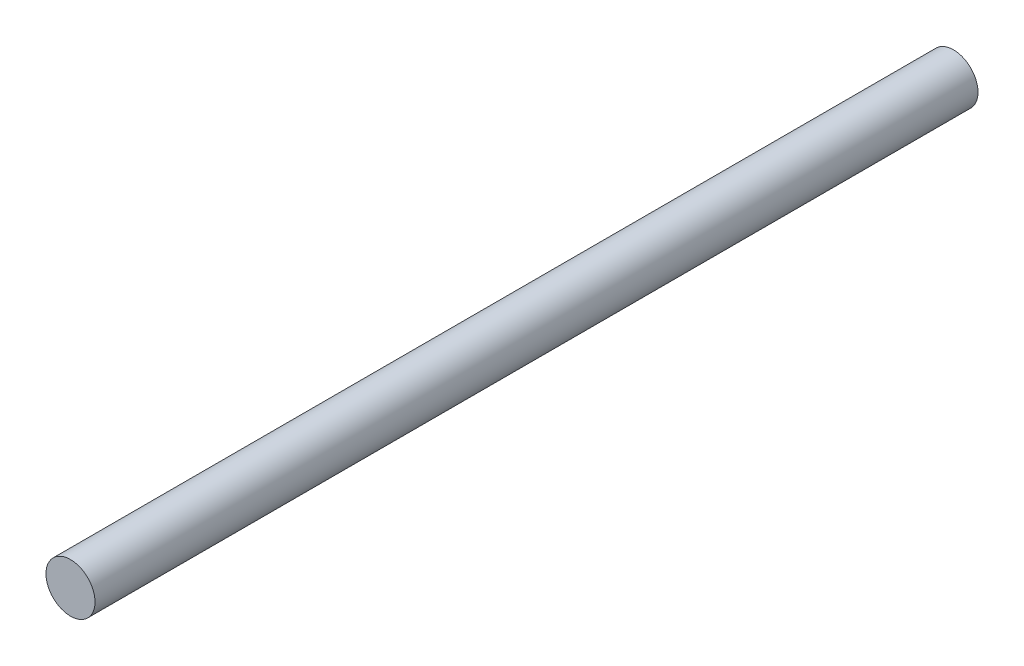
ISO-10303-21;
HEADER;
FILE_DESCRIPTION(('STEP AP214'),'2;1');
FILE_NAME('part.step','',(''),(''),'','','');
FILE_SCHEMA(('AUTOMOTIVE_DESIGN { 1 0 10303 214 1 1 1 1 }'));
ENDSEC;
DATA;
#1=APPLICATION_CONTEXT('core data for automotive mechanical design processes');
#2=APPLICATION_PROTOCOL_DEFINITION('international standard','automotive_design',2000,#1);
#3=PRODUCT_CONTEXT('',#1,'mechanical');
#4=PRODUCT('Part','Part','',(#3));
#5=PRODUCT_RELATED_PRODUCT_CATEGORY('part','',(#4));
#6=PRODUCT_DEFINITION_FORMATION('','',#4);
#7=PRODUCT_DEFINITION_CONTEXT('part definition',#1,'design');
#8=PRODUCT_DEFINITION('design','',#6,#7);
#9=PRODUCT_DEFINITION_SHAPE('','',#8);
#10=(LENGTH_UNIT() NAMED_UNIT(*) SI_UNIT(.MILLI.,.METRE.));
#11=(NAMED_UNIT(*) PLANE_ANGLE_UNIT() SI_UNIT($,.RADIAN.));
#12=(NAMED_UNIT(*) SI_UNIT($,.STERADIAN.) SOLID_ANGLE_UNIT());
#13=UNCERTAINTY_MEASURE_WITH_UNIT(LENGTH_MEASURE(1.E-05),#10,'distance_accuracy_value','');
#14=(GEOMETRIC_REPRESENTATION_CONTEXT(3) GLOBAL_UNCERTAINTY_ASSIGNED_CONTEXT((#13)) GLOBAL_UNIT_ASSIGNED_CONTEXT((#10,
#11,#12)) REPRESENTATION_CONTEXT('',''));
#15=CARTESIAN_POINT('',(0.,0.,0.));
#16=DIRECTION('',(0.,0.,1.));
#17=DIRECTION('',(1.,0.,0.));
#18=AXIS2_PLACEMENT_3D('',#15,#16,#17);
#19=CARTESIAN_POINT('',(0.,0.,45.));
#20=DIRECTION('',(0.,0.,-1.));
#21=DIRECTION('',(-1.,0.,0.));
#22=AXIS2_PLACEMENT_3D('',#19,#20,#21);
#23=CYLINDRICAL_SURFACE('',#22,1.25);
#24=CARTESIAN_POINT('',(0.,0.,45.));
#25=DIRECTION('',(0.,0.,1.));
#26=DIRECTION('',(1.,0.,0.));
#27=AXIS2_PLACEMENT_3D('',#24,#25,#26);
#28=CIRCLE('',#27,1.25);
#29=CARTESIAN_POINT('',(1.25,0.,45.));
#30=VERTEX_POINT('',#29);
#31=EDGE_CURVE('E10',#30,#30,#28,.T.);
#32=ORIENTED_EDGE('',*,*,#31,.F.);
#33=EDGE_LOOP('',(#32));
#34=FACE_BOUND('',#33,.T.);
#35=CARTESIAN_POINT('',(0.,0.,0.));
#36=DIRECTION('',(0.,0.,1.));
#37=DIRECTION('',(1.,0.,0.));
#38=AXIS2_PLACEMENT_3D('',#35,#36,#37);
#39=CIRCLE('',#38,1.25);
#40=CARTESIAN_POINT('',(1.25,0.,0.));
#41=VERTEX_POINT('',#40);
#42=EDGE_CURVE('E40',#41,#41,#39,.T.);
#43=ORIENTED_EDGE('',*,*,#42,.T.);
#44=EDGE_LOOP('',(#43));
#45=FACE_BOUND('',#44,.T.);
#46=ADVANCED_FACE('F37',(#34,#45),#23,.T.);
#47=CARTESIAN_POINT('',(0.,0.,45.));
#48=DIRECTION('',(0.,0.,1.));
#49=DIRECTION('',(1.,0.,0.));
#50=AXIS2_PLACEMENT_3D('',#47,#48,#49);
#51=PLANE('',#50);
#52=ORIENTED_EDGE('',*,*,#31,.T.);
#53=EDGE_LOOP('',(#52));
#54=FACE_BOUND('',#53,.T.);
#55=ADVANCED_FACE('F54',(#54),#51,.T.);
#56=CARTESIAN_POINT('',(0.,0.,0.));
#57=DIRECTION('',(0.,0.,1.));
#58=DIRECTION('',(1.,0.,0.));
#59=AXIS2_PLACEMENT_3D('',#56,#57,#58);
#60=PLANE('',#59);
#61=ORIENTED_EDGE('',*,*,#42,.F.);
#62=EDGE_LOOP('',(#61));
#63=FACE_BOUND('',#62,.T.);
#64=ADVANCED_FACE('F52',(#63),#60,.F.);
#65=CLOSED_SHELL('',(#46,#55,#64));
#66=MANIFOLD_SOLID_BREP('B2',#65);
#67=ADVANCED_BREP_SHAPE_REPRESENTATION('',(#18,#66),#14);
#68=SHAPE_DEFINITION_REPRESENTATION(#9,#67);
ENDSEC;
END-ISO-10303-21;
